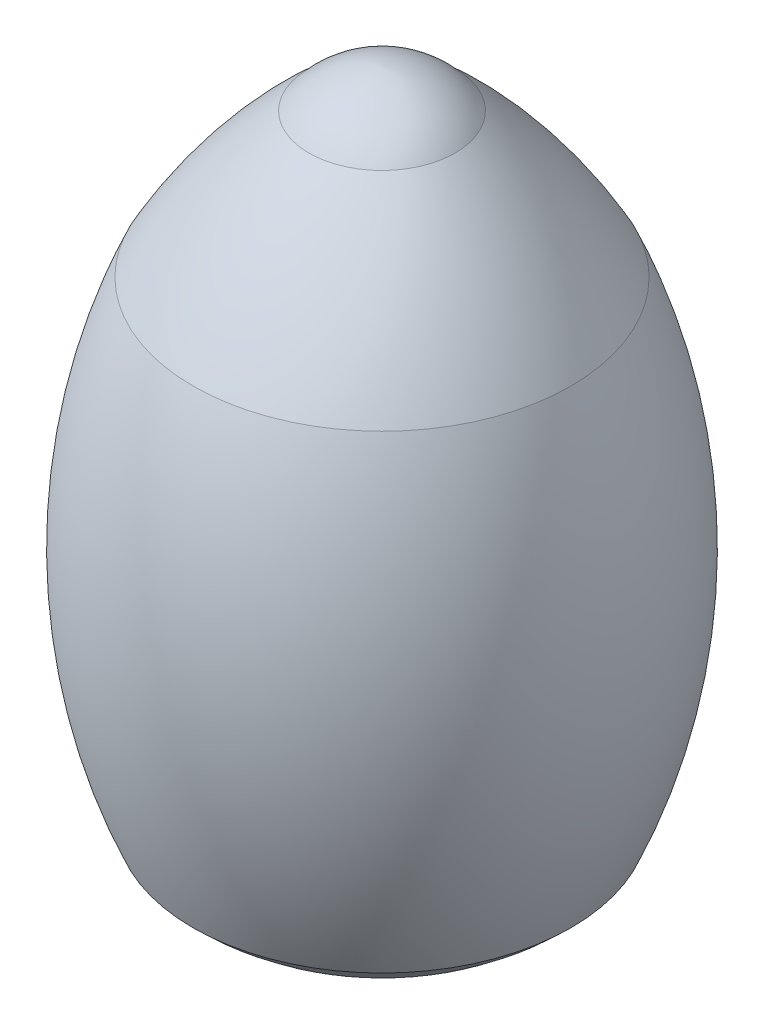
ISO-10303-21;
HEADER;
FILE_DESCRIPTION(('STEP AP214'),'2;1');
FILE_NAME('part.step','',(''),(''),'','','');
FILE_SCHEMA(('AUTOMOTIVE_DESIGN { 1 0 10303 214 1 1 1 1 }'));
ENDSEC;
DATA;
#1=APPLICATION_CONTEXT('core data for automotive mechanical design processes');
#2=APPLICATION_PROTOCOL_DEFINITION('international standard','automotive_design',2000,#1);
#3=PRODUCT_CONTEXT('',#1,'mechanical');
#4=PRODUCT('Part','Part','',(#3));
#5=PRODUCT_RELATED_PRODUCT_CATEGORY('part','',(#4));
#6=PRODUCT_DEFINITION_FORMATION('','',#4);
#7=PRODUCT_DEFINITION_CONTEXT('part definition',#1,'design');
#8=PRODUCT_DEFINITION('design','',#6,#7);
#9=PRODUCT_DEFINITION_SHAPE('','',#8);
#10=(LENGTH_UNIT() NAMED_UNIT(*) SI_UNIT(.MILLI.,.METRE.));
#11=(NAMED_UNIT(*) PLANE_ANGLE_UNIT() SI_UNIT($,.RADIAN.));
#12=(NAMED_UNIT(*) SI_UNIT($,.STERADIAN.) SOLID_ANGLE_UNIT());
#13=UNCERTAINTY_MEASURE_WITH_UNIT(LENGTH_MEASURE(1.E-05),#10,'distance_accuracy_value','');
#14=(GEOMETRIC_REPRESENTATION_CONTEXT(3) GLOBAL_UNCERTAINTY_ASSIGNED_CONTEXT((#13)) GLOBAL_UNIT_ASSIGNED_CONTEXT((#10,
#11,#12)) REPRESENTATION_CONTEXT('',''));
#15=CARTESIAN_POINT('',(0.,0.,0.));
#16=DIRECTION('',(0.,0.,1.));
#17=DIRECTION('',(1.,0.,0.));
#18=AXIS2_PLACEMENT_3D('',#15,#16,#17);
#19=CARTESIAN_POINT('',(0.,347.006586660865,36.2083036340903));
#20=DIRECTION('',(-1.,0.,0.));
#21=DIRECTION('',(0.,0.,-1.));
#22=AXIS2_PLACEMENT_3D('',#19,#20,#21);
#23=CIRCLE('',#22,348.890545068339);
#24=TRIMMED_CURVE('',#23,(PARAMETER_VALUE(-1.46682785174726)),
(PARAMETER_VALUE(1.46682785174726)),.T.,.PARAMETER.);
#25=CARTESIAN_POINT('',(0.,347.006586660865,0.));
#26=DIRECTION('',(0.,-1.,0.));
#27=AXIS1_PLACEMENT('',#25,#26);
#28=SURFACE_OF_REVOLUTION('',#24,#27);
#29=CARTESIAN_POINT('',(0.,0.,0.));
#30=VERTEX_POINT('',#29);
#31=VERTEX_LOOP('',#30);
#32=FACE_BOUND('',#31,.T.);
#33=CARTESIAN_POINT('',(0.,18.9843790940062,0.));
#34=DIRECTION('',(0.,-1.,0.));
#35=DIRECTION('',(0.,0.,-1.));
#36=AXIS2_PLACEMENT_3D('',#33,#34,#35);
#37=CIRCLE('',#36,82.6447307447066);
#38=CARTESIAN_POINT('',(0.,18.9843790940062,-82.6447307447066));
#39=VERTEX_POINT('',#38);
#40=EDGE_CURVE('E49',#39,#39,#37,.T.);
#41=ORIENTED_EDGE('',*,*,#40,.T.);
#42=EDGE_LOOP('',(#41));
#43=FACE_BOUND('',#42,.T.);
#44=ADVANCED_FACE('F31',(#32,#43),#28,.T.);
#45=CARTESIAN_POINT('',(0.,428.212743716885,5.00808180748125));
#46=DIRECTION('',(-1.,0.,0.));
#47=DIRECTION('',(0.,0.,-1.));
#48=AXIS2_PLACEMENT_3D('',#45,#46,#47);
#49=CIRCLE('',#48,71.9617332201503);
#50=TRIMMED_CURVE('',#49,(PARAMETER_VALUE(-1.50114634742356)),
(PARAMETER_VALUE(1.50114634742356)),.T.,.PARAMETER.);
#51=CARTESIAN_POINT('',(0.,428.212743716885,0.));
#52=DIRECTION('',(0.,-1.,0.));
#53=AXIS1_PLACEMENT('',#51,#52);
#54=SURFACE_OF_REVOLUTION('',#50,#53);
#55=CARTESIAN_POINT('',(0.,474.171765463053,0.));
#56=DIRECTION('',(0.,-1.,0.));
#57=DIRECTION('',(0.,0.,-1.));
#58=AXIS2_PLACEMENT_3D('',#55,#56,#57);
#59=CIRCLE('',#58,50.3657330167056);
#60=CARTESIAN_POINT('',(0.,474.171765463053,-50.3657330167056));
#61=VERTEX_POINT('',#60);
#62=EDGE_CURVE('E11',#61,#61,#59,.T.);
#63=ORIENTED_EDGE('',*,*,#62,.F.);
#64=EDGE_LOOP('',(#63));
#65=FACE_BOUND('',#64,.T.);
#66=CARTESIAN_POINT('',(0.,500.,0.));
#67=VERTEX_POINT('',#66);
#68=VERTEX_LOOP('',#67);
#69=FACE_BOUND('',#68,.T.);
#70=ADVANCED_FACE('F46',(#65,#69),#54,.T.);
#71=CARTESIAN_POINT('',(0.,192.29551893644,0.));
#72=DIRECTION('',(0.,-1.,0.));
#73=DIRECTION('',(0.,0.,-1.));
#74=AXIS2_PLACEMENT_3D('',#71,#72,#73);
#75=DEGENERATE_TOROIDAL_SURFACE('',#74,198.990759561675,376.341439050928,.F.);
#76=CARTESIAN_POINT('',(0.,375.046603392746,0.));
#77=DIRECTION('',(0.,-1.,0.));
#78=DIRECTION('',(0.,0.,-1.));
#79=AXIS2_PLACEMENT_3D('',#76,#77,#78);
#80=CIRCLE('',#79,130.);
#81=CARTESIAN_POINT('',(0.,375.046603392746,-130.));
#82=VERTEX_POINT('',#81);
#83=EDGE_CURVE('E38',#82,#82,#80,.T.);
#84=ORIENTED_EDGE('',*,*,#83,.F.);
#85=EDGE_LOOP('',(#84));
#86=FACE_BOUND('',#85,.T.);
#87=ORIENTED_EDGE('',*,*,#62,.T.);
#88=EDGE_LOOP('',(#87));
#89=FACE_BOUND('',#88,.T.);
#90=ADVANCED_FACE('F60',(#86,#89),#75,.F.);
#91=CARTESIAN_POINT('',(0.,213.54966681737,0.));
#92=DIRECTION('',(0.,-1.,0.));
#93=DIRECTION('',(0.,0.,-1.));
#94=AXIS2_PLACEMENT_3D('',#91,#92,#93);
#95=DEGENERATE_TOROIDAL_SURFACE('',#94,245.602820097925,408.850509341428,.F.);
#96=CARTESIAN_POINT('',(0.,52.0527302419943,0.));
#97=DIRECTION('',(0.,-1.,0.));
#98=DIRECTION('',(0.,0.,-1.));
#99=AXIS2_PLACEMENT_3D('',#96,#97,#98);
#100=CIRCLE('',#99,130.);
#101=CARTESIAN_POINT('',(0.,52.0527302419943,-130.));
#102=VERTEX_POINT('',#101);
#103=EDGE_CURVE('E51',#102,#102,#100,.T.);
#104=ORIENTED_EDGE('',*,*,#103,.F.);
#105=EDGE_LOOP('',(#104));
#106=FACE_BOUND('',#105,.T.);
#107=ORIENTED_EDGE('',*,*,#83,.T.);
#108=EDGE_LOOP('',(#107));
#109=FACE_BOUND('',#108,.T.);
#110=ADVANCED_FACE('F58',(#106,#109),#95,.F.);
#111=CARTESIAN_POINT('',(0.,167.039871386965,0.));
#112=DIRECTION('',(0.,-1.,0.));
#113=DIRECTION('',(0.,0.,-1.));
#114=AXIS2_PLACEMENT_3D('',#111,#112,#113);
#115=DEGENERATE_TOROIDAL_SURFACE('',#114,14.4805671289126,162.993196175641,.T.);
#116=ORIENTED_EDGE('',*,*,#40,.F.);
#117=EDGE_LOOP('',(#116));
#118=FACE_BOUND('',#117,.T.);
#119=ORIENTED_EDGE('',*,*,#103,.T.);
#120=EDGE_LOOP('',(#119));
#121=FACE_BOUND('',#120,.T.);
#122=ADVANCED_FACE('F72',(#118,#121),#115,.T.);
#123=CLOSED_SHELL('',(#44,#70,#90,#110,#122));
#124=MANIFOLD_SOLID_BREP('B2',#123);
#125=ADVANCED_BREP_SHAPE_REPRESENTATION('',(#18,#124),#14);
#126=SHAPE_DEFINITION_REPRESENTATION(#9,#125);
ENDSEC;
END-ISO-10303-21;
